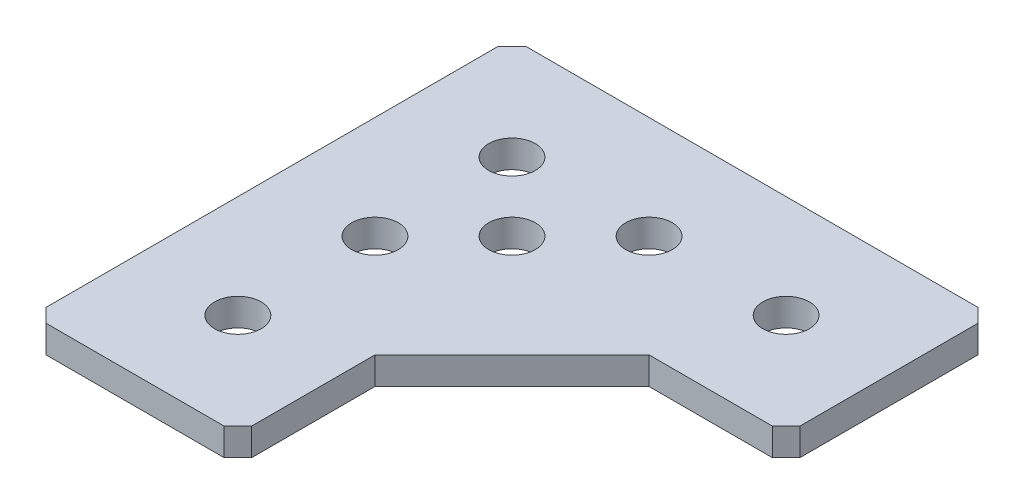
ISO-10303-21;
HEADER;
FILE_DESCRIPTION(('STEP AP214'),'2;1');
FILE_NAME('part.step','',(''),(''),'','','');
FILE_SCHEMA(('AUTOMOTIVE_DESIGN { 1 0 10303 214 1 1 1 1 }'));
ENDSEC;
DATA;
#1=APPLICATION_CONTEXT('core data for automotive mechanical design processes');
#2=APPLICATION_PROTOCOL_DEFINITION('international standard','automotive_design',2000,#1);
#3=PRODUCT_CONTEXT('',#1,'mechanical');
#4=PRODUCT('Part','Part','',(#3));
#5=PRODUCT_RELATED_PRODUCT_CATEGORY('part','',(#4));
#6=PRODUCT_DEFINITION_FORMATION('','',#4);
#7=PRODUCT_DEFINITION_CONTEXT('part definition',#1,'design');
#8=PRODUCT_DEFINITION('design','',#6,#7);
#9=PRODUCT_DEFINITION_SHAPE('','',#8);
#10=(LENGTH_UNIT() NAMED_UNIT(*) SI_UNIT(.MILLI.,.METRE.));
#11=(NAMED_UNIT(*) PLANE_ANGLE_UNIT() SI_UNIT($,.RADIAN.));
#12=(NAMED_UNIT(*) SI_UNIT($,.STERADIAN.) SOLID_ANGLE_UNIT());
#13=UNCERTAINTY_MEASURE_WITH_UNIT(LENGTH_MEASURE(1.E-05),#10,'distance_accuracy_value','');
#14=(GEOMETRIC_REPRESENTATION_CONTEXT(3) GLOBAL_UNCERTAINTY_ASSIGNED_CONTEXT((#13)) GLOBAL_UNIT_ASSIGNED_CONTEXT((#10,
#11,#12)) REPRESENTATION_CONTEXT('',''));
#15=CARTESIAN_POINT('',(0.,0.,0.));
#16=DIRECTION('',(0.,0.,1.));
#17=DIRECTION('',(1.,0.,0.));
#18=AXIS2_PLACEMENT_3D('',#15,#16,#17);
#19=CARTESIAN_POINT('',(-7.5,2.,-6.49999999999999));
#20=DIRECTION('',(0.707106781186548,0.,0.707106781186548));
#21=DIRECTION('',(0.707106781186548,0.,-0.707106781186548));
#22=AXIS2_PLACEMENT_3D('',#19,#20,#21);
#23=PLANE('',#22);
#24=DIRECTION('',(0.,1.,0.));
#25=VECTOR('',#24,1.);
#26=CARTESIAN_POINT('',(-6.49999999999999,2.,-7.5));
#27=LINE('',#26,#25);
#28=CARTESIAN_POINT('',(-6.49999999999999,2.,-7.5));
#29=VERTEX_POINT('',#28);
#30=CARTESIAN_POINT('',(-6.49999999999999,0.,-7.5));
#31=VERTEX_POINT('',#30);
#32=EDGE_CURVE('E101',#29,#31,#27,.F.);
#33=ORIENTED_EDGE('',*,*,#32,.T.);
#34=DIRECTION('',(-0.707106781186547,0.,0.707106781186547));
#35=VECTOR('',#34,1.);
#36=CARTESIAN_POINT('',(-6.49999999999999,0.,-7.5));
#37=LINE('',#36,#35);
#38=CARTESIAN_POINT('',(-7.5,0.,-6.49999999999999));
#39=VERTEX_POINT('',#38);
#40=EDGE_CURVE('E115',#31,#39,#37,.T.);
#41=ORIENTED_EDGE('',*,*,#40,.T.);
#42=DIRECTION('',(0.,1.,0.));
#43=VECTOR('',#42,1.);
#44=CARTESIAN_POINT('',(-7.5,2.,-6.49999999999999));
#45=LINE('',#44,#43);
#46=CARTESIAN_POINT('',(-7.5,2.,-6.49999999999999));
#47=VERTEX_POINT('',#46);
#48=EDGE_CURVE('E216',#39,#47,#45,.T.);
#49=ORIENTED_EDGE('',*,*,#48,.T.);
#50=DIRECTION('',(0.707106781186548,0.,-0.707106781186548));
#51=VECTOR('',#50,1.);
#52=CARTESIAN_POINT('',(-7.5,2.,-6.49999999999999));
#53=LINE('',#52,#51);
#54=EDGE_CURVE('E146',#29,#47,#53,.F.);
#55=ORIENTED_EDGE('',*,*,#54,.F.);
#56=EDGE_LOOP('',(#33,#41,#49,#55));
#57=FACE_BOUND('',#56,.T.);
#58=ADVANCED_FACE('F17',(#57),#23,.F.);
#59=CARTESIAN_POINT('',(-6.5,2.,27.5));
#60=DIRECTION('',(0.707106781186551,0.,-0.707106781186544));
#61=DIRECTION('',(-0.707106781186544,0.,-0.707106781186551));
#62=AXIS2_PLACEMENT_3D('',#59,#60,#61);
#63=PLANE('',#62);
#64=DIRECTION('',(0.,1.,0.));
#65=VECTOR('',#64,1.);
#66=CARTESIAN_POINT('',(-7.50000000000001,2.,26.5));
#67=LINE('',#66,#65);
#68=CARTESIAN_POINT('',(-7.50000000000001,2.,26.5));
#69=VERTEX_POINT('',#68);
#70=CARTESIAN_POINT('',(-7.50000000000001,0.,26.5));
#71=VERTEX_POINT('',#70);
#72=EDGE_CURVE('E124',#69,#71,#67,.F.);
#73=ORIENTED_EDGE('',*,*,#72,.T.);
#74=DIRECTION('',(0.707106781186544,0.,0.707106781186552));
#75=VECTOR('',#74,1.);
#76=CARTESIAN_POINT('',(-7.50000000000001,0.,26.5));
#77=LINE('',#76,#75);
#78=CARTESIAN_POINT('',(-6.5,0.,27.5));
#79=VERTEX_POINT('',#78);
#80=EDGE_CURVE('E137',#71,#79,#77,.T.);
#81=ORIENTED_EDGE('',*,*,#80,.T.);
#82=DIRECTION('',(0.,1.,0.));
#83=VECTOR('',#82,1.);
#84=CARTESIAN_POINT('',(-6.5,2.,27.5));
#85=LINE('',#84,#83);
#86=CARTESIAN_POINT('',(-6.5,2.,27.5));
#87=VERTEX_POINT('',#86);
#88=EDGE_CURVE('E208',#79,#87,#85,.T.);
#89=ORIENTED_EDGE('',*,*,#88,.T.);
#90=DIRECTION('',(-0.707106781186544,0.,-0.707106781186551));
#91=VECTOR('',#90,1.);
#92=CARTESIAN_POINT('',(-6.5,2.,27.5));
#93=LINE('',#92,#91);
#94=EDGE_CURVE('E144',#69,#87,#93,.F.);
#95=ORIENTED_EDGE('',*,*,#94,.F.);
#96=EDGE_LOOP('',(#73,#81,#89,#95));
#97=FACE_BOUND('',#96,.T.);
#98=ADVANCED_FACE('F224',(#97),#63,.F.);
#99=CARTESIAN_POINT('',(7.50000000000001,2.,26.5));
#100=DIRECTION('',(-0.707106781186546,0.,-0.707106781186549));
#101=DIRECTION('',(-0.707106781186549,0.,0.707106781186546));
#102=AXIS2_PLACEMENT_3D('',#99,#100,#101);
#103=PLANE('',#102);
#104=DIRECTION('',(0.,1.,0.));
#105=VECTOR('',#104,1.);
#106=CARTESIAN_POINT('',(6.5,2.,27.5));
#107=LINE('',#106,#105);
#108=CARTESIAN_POINT('',(6.5,2.,27.5));
#109=VERTEX_POINT('',#108);
#110=CARTESIAN_POINT('',(6.5,0.,27.5));
#111=VERTEX_POINT('',#110);
#112=EDGE_CURVE('E214',#109,#111,#107,.F.);
#113=ORIENTED_EDGE('',*,*,#112,.T.);
#114=DIRECTION('',(0.707106781186547,0.,-0.707106781186547));
#115=VECTOR('',#114,1.);
#116=CARTESIAN_POINT('',(6.5,0.,27.5));
#117=LINE('',#116,#115);
#118=CARTESIAN_POINT('',(7.50000000000001,0.,26.5));
#119=VERTEX_POINT('',#118);
#120=EDGE_CURVE('E135',#111,#119,#117,.T.);
#121=ORIENTED_EDGE('',*,*,#120,.T.);
#122=DIRECTION('',(0.,1.,0.));
#123=VECTOR('',#122,1.);
#124=CARTESIAN_POINT('',(7.50000000000001,2.,26.5));
#125=LINE('',#124,#123);
#126=CARTESIAN_POINT('',(7.50000000000001,2.,26.5));
#127=VERTEX_POINT('',#126);
#128=EDGE_CURVE('E202',#119,#127,#125,.T.);
#129=ORIENTED_EDGE('',*,*,#128,.T.);
#130=DIRECTION('',(-0.707106781186549,0.,0.707106781186546));
#131=VECTOR('',#130,1.);
#132=CARTESIAN_POINT('',(7.50000000000001,2.,26.5));
#133=LINE('',#132,#131);
#134=EDGE_CURVE('E142',#109,#127,#133,.F.);
#135=ORIENTED_EDGE('',*,*,#134,.F.);
#136=EDGE_LOOP('',(#113,#121,#129,#135));
#137=FACE_BOUND('',#136,.T.);
#138=ADVANCED_FACE('F270',(#137),#103,.F.);
#139=CARTESIAN_POINT('',(26.5000000000001,2.,-7.5));
#140=DIRECTION('',(-0.707106781186543,0.,0.707106781186552));
#141=DIRECTION('',(0.707106781186552,0.,0.707106781186543));
#142=AXIS2_PLACEMENT_3D('',#139,#140,#141);
#143=PLANE('',#142);
#144=DIRECTION('',(0.,1.,0.));
#145=VECTOR('',#144,1.);
#146=CARTESIAN_POINT('',(27.5,2.,-6.50000000000009));
#147=LINE('',#146,#145);
#148=CARTESIAN_POINT('',(27.5,2.,-6.50000000000009));
#149=VERTEX_POINT('',#148);
#150=CARTESIAN_POINT('',(27.5,0.,-6.50000000000009));
#151=VERTEX_POINT('',#150);
#152=EDGE_CURVE('E111',#149,#151,#147,.F.);
#153=ORIENTED_EDGE('',*,*,#152,.T.);
#154=DIRECTION('',(-0.707106781186554,0.,-0.70710678118654));
#155=VECTOR('',#154,1.);
#156=CARTESIAN_POINT('',(27.5,0.,-6.5000000000001));
#157=LINE('',#156,#155);
#158=CARTESIAN_POINT('',(26.5000000000001,0.,-7.5));
#159=VERTEX_POINT('',#158);
#160=EDGE_CURVE('E105',#151,#159,#157,.T.);
#161=ORIENTED_EDGE('',*,*,#160,.T.);
#162=DIRECTION('',(0.,1.,0.));
#163=VECTOR('',#162,1.);
#164=CARTESIAN_POINT('',(26.5000000000001,2.,-7.5));
#165=LINE('',#164,#163);
#166=CARTESIAN_POINT('',(26.5000000000001,2.,-7.5));
#167=VERTEX_POINT('',#166);
#168=EDGE_CURVE('E109',#159,#167,#165,.T.);
#169=ORIENTED_EDGE('',*,*,#168,.T.);
#170=DIRECTION('',(0.707106781186552,0.,0.707106781186543));
#171=VECTOR('',#170,1.);
#172=CARTESIAN_POINT('',(26.5000000000001,2.,-7.5));
#173=LINE('',#172,#171);
#174=EDGE_CURVE('E35',#149,#167,#173,.F.);
#175=ORIENTED_EDGE('',*,*,#174,.F.);
#176=EDGE_LOOP('',(#153,#161,#169,#175));
#177=FACE_BOUND('',#176,.T.);
#178=ADVANCED_FACE('F107',(#177),#143,.F.);
#179=CARTESIAN_POINT('',(27.5,2.,6.4999999999999));
#180=DIRECTION('',(-0.707106781186549,0.,-0.707106781186546));
#181=DIRECTION('',(-0.707106781186546,0.,0.707106781186549));
#182=AXIS2_PLACEMENT_3D('',#179,#180,#181);
#183=PLANE('',#182);
#184=DIRECTION('',(0.,1.,0.));
#185=VECTOR('',#184,1.);
#186=CARTESIAN_POINT('',(26.5,2.,7.49999999999991));
#187=LINE('',#186,#185);
#188=CARTESIAN_POINT('',(26.5,2.,7.49999999999992));
#189=VERTEX_POINT('',#188);
#190=CARTESIAN_POINT('',(26.5,0.,7.49999999999992));
#191=VERTEX_POINT('',#190);
#192=EDGE_CURVE('E193',#189,#191,#187,.F.);
#193=ORIENTED_EDGE('',*,*,#192,.T.);
#194=DIRECTION('',(0.707106781186546,0.,-0.707106781186549));
#195=VECTOR('',#194,1.);
#196=CARTESIAN_POINT('',(26.5,0.,7.49999999999991));
#197=LINE('',#196,#195);
#198=CARTESIAN_POINT('',(27.5,0.,6.4999999999999));
#199=VERTEX_POINT('',#198);
#200=EDGE_CURVE('E116',#191,#199,#197,.T.);
#201=ORIENTED_EDGE('',*,*,#200,.T.);
#202=DIRECTION('',(0.,1.,0.));
#203=VECTOR('',#202,1.);
#204=CARTESIAN_POINT('',(27.5,2.,6.4999999999999));
#205=LINE('',#204,#203);
#206=CARTESIAN_POINT('',(27.5,2.,6.4999999999999));
#207=VERTEX_POINT('',#206);
#208=EDGE_CURVE('E176',#199,#207,#205,.T.);
#209=ORIENTED_EDGE('',*,*,#208,.T.);
#210=DIRECTION('',(-0.707106781186546,0.,0.707106781186549));
#211=VECTOR('',#210,1.);
#212=CARTESIAN_POINT('',(27.5,2.,6.4999999999999));
#213=LINE('',#212,#211);
#214=EDGE_CURVE('E139',#189,#207,#213,.F.);
#215=ORIENTED_EDGE('',*,*,#214,.F.);
#216=EDGE_LOOP('',(#193,#201,#209,#215));
#217=FACE_BOUND('',#216,.T.);
#218=ADVANCED_FACE('F412',(#217),#183,.F.);
#219=CARTESIAN_POINT('',(0.,0.,0.));
#220=DIRECTION('',(0.,1.,0.));
#221=DIRECTION('',(0.,0.,1.));
#222=AXIS2_PLACEMENT_3D('',#219,#220,#221);
#223=PLANE('',#222);
#224=CARTESIAN_POINT('',(0.,0.,10.));
#225=DIRECTION('',(0.,-1.,0.));
#226=DIRECTION('',(0.,0.,-1.));
#227=AXIS2_PLACEMENT_3D('',#224,#225,#226);
#228=CIRCLE('',#227,1.7);
#229=CARTESIAN_POINT('',(0.,0.,8.30000000000001));
#230=VERTEX_POINT('',#229);
#231=EDGE_CURVE('E163',#230,#230,#228,.F.);
#232=ORIENTED_EDGE('',*,*,#231,.T.);
#233=EDGE_LOOP('',(#232));
#234=FACE_BOUND('',#233,.T.);
#235=CARTESIAN_POINT('',(0.,0.,20.));
#236=DIRECTION('',(0.,-1.,0.));
#237=DIRECTION('',(0.,0.,-1.));
#238=AXIS2_PLACEMENT_3D('',#235,#236,#237);
#239=CIRCLE('',#238,1.7);
#240=CARTESIAN_POINT('',(0.,0.,18.3));
#241=VERTEX_POINT('',#240);
#242=EDGE_CURVE('E166',#241,#241,#239,.F.);
#243=ORIENTED_EDGE('',*,*,#242,.T.);
#244=EDGE_LOOP('',(#243));
#245=FACE_BOUND('',#244,.T.);
#246=CARTESIAN_POINT('',(10.,0.,0.));
#247=DIRECTION('',(0.,-1.,0.));
#248=DIRECTION('',(0.,0.,-1.));
#249=AXIS2_PLACEMENT_3D('',#246,#247,#248);
#250=CIRCLE('',#249,1.7);
#251=CARTESIAN_POINT('',(10.,0.,-1.70000000000004));
#252=VERTEX_POINT('',#251);
#253=EDGE_CURVE('E169',#252,#252,#250,.F.);
#254=ORIENTED_EDGE('',*,*,#253,.T.);
#255=EDGE_LOOP('',(#254));
#256=FACE_BOUND('',#255,.T.);
#257=CARTESIAN_POINT('',(20.,0.,0.));
#258=DIRECTION('',(0.,-1.,0.));
#259=DIRECTION('',(0.,0.,-1.));
#260=AXIS2_PLACEMENT_3D('',#257,#258,#259);
#261=CIRCLE('',#260,1.7);
#262=CARTESIAN_POINT('',(20.,0.,-1.70000000000008));
#263=VERTEX_POINT('',#262);
#264=EDGE_CURVE('E172',#263,#263,#261,.F.);
#265=ORIENTED_EDGE('',*,*,#264,.T.);
#266=EDGE_LOOP('',(#265));
#267=FACE_BOUND('',#266,.T.);
#268=CARTESIAN_POINT('',(0.,0.,0.));
#269=DIRECTION('',(0.,-1.,0.));
#270=DIRECTION('',(0.,0.,-1.));
#271=AXIS2_PLACEMENT_3D('',#268,#269,#270);
#272=CIRCLE('',#271,1.7);
#273=CARTESIAN_POINT('',(0.,0.,-1.69999999999999));
#274=VERTEX_POINT('',#273);
#275=EDGE_CURVE('E174',#274,#274,#272,.F.);
#276=ORIENTED_EDGE('',*,*,#275,.T.);
#277=EDGE_LOOP('',(#276));
#278=FACE_BOUND('',#277,.T.);
#279=ORIENTED_EDGE('',*,*,#40,.F.);
#280=DIRECTION('',(1.,0.,0.));
#281=VECTOR('',#280,1.);
#282=CARTESIAN_POINT('',(-7.5,0.,-7.5));
#283=LINE('',#282,#281);
#284=EDGE_CURVE('E119',#31,#159,#283,.T.);
#285=ORIENTED_EDGE('',*,*,#284,.T.);
#286=ORIENTED_EDGE('',*,*,#160,.F.);
#287=DIRECTION('',(0.,0.,1.));
#288=VECTOR('',#287,1.);
#289=CARTESIAN_POINT('',(27.5,0.,7.4999999999999));
#290=LINE('',#289,#288);
#291=EDGE_CURVE('E180',#151,#199,#290,.T.);
#292=ORIENTED_EDGE('',*,*,#291,.T.);
#293=ORIENTED_EDGE('',*,*,#200,.F.);
#294=DIRECTION('',(-1.,0.,0.));
#295=VECTOR('',#294,1.);
#296=CARTESIAN_POINT('',(-7.49999999999997,0.,7.50000000000002));
#297=LINE('',#296,#295);
#298=CARTESIAN_POINT('',(17.5000000000001,0.,7.49999999999994));
#299=VERTEX_POINT('',#298);
#300=EDGE_CURVE('E190',#191,#299,#297,.T.);
#301=ORIENTED_EDGE('',*,*,#300,.T.);
#302=DIRECTION('',(0.707106781186551,0.,-0.707106781186544));
#303=VECTOR('',#302,1.);
#304=CARTESIAN_POINT('',(17.5000000000001,0.,7.49999999999994));
#305=LINE('',#304,#303);
#306=CARTESIAN_POINT('',(7.50000000000001,0.,17.4999999999999));
#307=VERTEX_POINT('',#306);
#308=EDGE_CURVE('E197',#307,#299,#305,.T.);
#309=ORIENTED_EDGE('',*,*,#308,.F.);
#310=DIRECTION('',(0.,0.,1.));
#311=VECTOR('',#310,1.);
#312=CARTESIAN_POINT('',(7.50000000000001,0.,-7.5));
#313=LINE('',#312,#311);
#314=EDGE_CURVE('E205',#307,#119,#313,.T.);
#315=ORIENTED_EDGE('',*,*,#314,.T.);
#316=ORIENTED_EDGE('',*,*,#120,.F.);
#317=DIRECTION('',(-1.,0.,0.));
#318=VECTOR('',#317,1.);
#319=CARTESIAN_POINT('',(-7.5,0.,27.5));
#320=LINE('',#319,#318);
#321=EDGE_CURVE('E211',#111,#79,#320,.T.);
#322=ORIENTED_EDGE('',*,*,#321,.T.);
#323=ORIENTED_EDGE('',*,*,#80,.F.);
#324=DIRECTION('',(0.,0.,-1.));
#325=VECTOR('',#324,1.);
#326=CARTESIAN_POINT('',(-7.5,0.,-7.5));
#327=LINE('',#326,#325);
#328=EDGE_CURVE('E219',#71,#39,#327,.T.);
#329=ORIENTED_EDGE('',*,*,#328,.T.);
#330=EDGE_LOOP('',(#279,#285,#286,#292,#293,#301,#309,#315,#316,#322,#323,#329));
#331=FACE_BOUND('',#330,.T.);
#332=CARTESIAN_POINT('',(5.,0.,5.00000000000001));
#333=DIRECTION('',(0.,1.,0.));
#334=DIRECTION('',(0.,0.,1.));
#335=AXIS2_PLACEMENT_3D('',#332,#333,#334);
#336=CIRCLE('',#335,1.7);
#337=CARTESIAN_POINT('',(5.,0.,6.70000000000001));
#338=VERTEX_POINT('',#337);
#339=EDGE_CURVE('E20',#338,#338,#336,.T.);
#340=ORIENTED_EDGE('',*,*,#339,.T.);
#341=EDGE_LOOP('',(#340));
#342=FACE_BOUND('',#341,.T.);
#343=ADVANCED_FACE('F120',(#234,#245,#256,#267,#278,#331,#342),#223,.F.);
#344=CARTESIAN_POINT('',(5.,-1.175,5.00000000000001));
#345=DIRECTION('',(0.,1.,0.));
#346=DIRECTION('',(0.,0.,1.));
#347=AXIS2_PLACEMENT_3D('',#344,#345,#346);
#348=CYLINDRICAL_SURFACE('',#347,1.7);
#349=CARTESIAN_POINT('',(5.,2.,5.00000000000001));
#350=DIRECTION('',(0.,1.,0.));
#351=DIRECTION('',(0.,0.,1.));
#352=AXIS2_PLACEMENT_3D('',#349,#350,#351);
#353=CIRCLE('',#352,1.7);
#354=CARTESIAN_POINT('',(5.,2.,6.70000000000001));
#355=VERTEX_POINT('',#354);
#356=EDGE_CURVE('E160',#355,#355,#353,.F.);
#357=ORIENTED_EDGE('',*,*,#356,.F.);
#358=EDGE_LOOP('',(#357));
#359=FACE_BOUND('',#358,.T.);
#360=ORIENTED_EDGE('',*,*,#339,.F.);
#361=EDGE_LOOP('',(#360));
#362=FACE_BOUND('',#361,.T.);
#363=ADVANCED_FACE('F396',(#359,#362),#348,.F.);
#364=CARTESIAN_POINT('',(-7.5,2.,-7.5));
#365=DIRECTION('',(0.,0.,1.));
#366=DIRECTION('',(1.,0.,0.));
#367=AXIS2_PLACEMENT_3D('',#364,#365,#366);
#368=PLANE('',#367);
#369=ORIENTED_EDGE('',*,*,#32,.F.);
#370=DIRECTION('',(1.,0.,0.));
#371=VECTOR('',#370,1.);
#372=CARTESIAN_POINT('',(0.,2.,-7.5));
#373=LINE('',#372,#371);
#374=EDGE_CURVE('E128',#167,#29,#373,.F.);
#375=ORIENTED_EDGE('',*,*,#374,.F.);
#376=ORIENTED_EDGE('',*,*,#168,.F.);
#377=ORIENTED_EDGE('',*,*,#284,.F.);
#378=EDGE_LOOP('',(#369,#375,#376,#377));
#379=FACE_BOUND('',#378,.T.);
#380=ADVANCED_FACE('F126',(#379),#368,.F.);
#381=CARTESIAN_POINT('',(-7.5,2.,-7.5));
#382=DIRECTION('',(1.,0.,0.));
#383=DIRECTION('',(0.,0.,-1.));
#384=AXIS2_PLACEMENT_3D('',#381,#382,#383);
#385=PLANE('',#384);
#386=ORIENTED_EDGE('',*,*,#48,.F.);
#387=ORIENTED_EDGE('',*,*,#328,.F.);
#388=ORIENTED_EDGE('',*,*,#72,.F.);
#389=DIRECTION('',(0.,0.,1.));
#390=VECTOR('',#389,1.);
#391=CARTESIAN_POINT('',(-7.5,2.,0.));
#392=LINE('',#391,#390);
#393=EDGE_CURVE('E234',#47,#69,#392,.T.);
#394=ORIENTED_EDGE('',*,*,#393,.F.);
#395=EDGE_LOOP('',(#386,#387,#388,#394));
#396=FACE_BOUND('',#395,.T.);
#397=ADVANCED_FACE('F233',(#396),#385,.F.);
#398=CARTESIAN_POINT('',(-7.5,2.,27.5));
#399=DIRECTION('',(0.,0.,-1.));
#400=DIRECTION('',(-1.,0.,0.));
#401=AXIS2_PLACEMENT_3D('',#398,#399,#400);
#402=PLANE('',#401);
#403=ORIENTED_EDGE('',*,*,#88,.F.);
#404=ORIENTED_EDGE('',*,*,#321,.F.);
#405=ORIENTED_EDGE('',*,*,#112,.F.);
#406=DIRECTION('',(1.,0.,0.));
#407=VECTOR('',#406,1.);
#408=CARTESIAN_POINT('',(0.,2.,27.5));
#409=LINE('',#408,#407);
#410=EDGE_CURVE('E239',#87,#109,#409,.T.);
#411=ORIENTED_EDGE('',*,*,#410,.F.);
#412=EDGE_LOOP('',(#403,#404,#405,#411));
#413=FACE_BOUND('',#412,.T.);
#414=ADVANCED_FACE('F274',(#413),#402,.F.);
#415=CARTESIAN_POINT('',(7.50000000000001,2.,-7.5));
#416=DIRECTION('',(-1.,0.,0.));
#417=DIRECTION('',(0.,0.,1.));
#418=AXIS2_PLACEMENT_3D('',#415,#416,#417);
#419=PLANE('',#418);
#420=ORIENTED_EDGE('',*,*,#128,.F.);
#421=ORIENTED_EDGE('',*,*,#314,.F.);
#422=DIRECTION('',(0.,1.,0.));
#423=VECTOR('',#422,1.);
#424=CARTESIAN_POINT('',(7.50000000000001,2.,17.4999999999999));
#425=LINE('',#424,#423);
#426=CARTESIAN_POINT('',(7.50000000000001,2.,17.4999999999999));
#427=VERTEX_POINT('',#426);
#428=EDGE_CURVE('E199',#427,#307,#425,.F.);
#429=ORIENTED_EDGE('',*,*,#428,.F.);
#430=DIRECTION('',(0.,0.,1.));
#431=VECTOR('',#430,1.);
#432=CARTESIAN_POINT('',(7.50000000000001,2.,0.));
#433=LINE('',#432,#431);
#434=EDGE_CURVE('E241',#127,#427,#433,.F.);
#435=ORIENTED_EDGE('',*,*,#434,.F.);
#436=EDGE_LOOP('',(#420,#421,#429,#435));
#437=FACE_BOUND('',#436,.T.);
#438=ADVANCED_FACE('F268',(#437),#419,.F.);
#439=CARTESIAN_POINT('',(17.5000000000001,2.,7.49999999999994));
#440=DIRECTION('',(0.707106781186544,0.,0.707106781186551));
#441=DIRECTION('',(0.707106781186551,0.,-0.707106781186544));
#442=AXIS2_PLACEMENT_3D('',#439,#440,#441);
#443=PLANE('',#442);
#444=ORIENTED_EDGE('',*,*,#308,.T.);
#445=DIRECTION('',(0.,1.,0.));
#446=VECTOR('',#445,1.);
#447=CARTESIAN_POINT('',(17.5000000000001,2.,7.49999999999994));
#448=LINE('',#447,#446);
#449=CARTESIAN_POINT('',(17.5000000000001,2.,7.49999999999994));
#450=VERTEX_POINT('',#449);
#451=EDGE_CURVE('E195',#299,#450,#448,.T.);
#452=ORIENTED_EDGE('',*,*,#451,.T.);
#453=DIRECTION('',(0.707106781186551,0.,-0.707106781186544));
#454=VECTOR('',#453,1.);
#455=CARTESIAN_POINT('',(7.50000000000001,2.,17.4999999999999));
#456=LINE('',#455,#454);
#457=EDGE_CURVE('E246',#427,#450,#456,.T.);
#458=ORIENTED_EDGE('',*,*,#457,.F.);
#459=ORIENTED_EDGE('',*,*,#428,.T.);
#460=EDGE_LOOP('',(#444,#452,#458,#459));
#461=FACE_BOUND('',#460,.T.);
#462=ADVANCED_FACE('F264',(#461),#443,.T.);
#463=CARTESIAN_POINT('',(-7.49999999999997,2.,7.50000000000002));
#464=DIRECTION('',(0.,0.,-1.));
#465=DIRECTION('',(-1.,0.,0.));
#466=AXIS2_PLACEMENT_3D('',#463,#464,#465);
#467=PLANE('',#466);
#468=ORIENTED_EDGE('',*,*,#192,.F.);
#469=DIRECTION('',(1.,0.,0.));
#470=VECTOR('',#469,1.);
#471=CARTESIAN_POINT('',(0.,2.,7.49999999999994));
#472=LINE('',#471,#470);
#473=EDGE_CURVE('E249',#450,#189,#472,.T.);
#474=ORIENTED_EDGE('',*,*,#473,.F.);
#475=ORIENTED_EDGE('',*,*,#451,.F.);
#476=ORIENTED_EDGE('',*,*,#300,.F.);
#477=EDGE_LOOP('',(#468,#474,#475,#476));
#478=FACE_BOUND('',#477,.T.);
#479=ADVANCED_FACE('F260',(#478),#467,.F.);
#480=CARTESIAN_POINT('',(27.5,2.,7.4999999999999));
#481=DIRECTION('',(-1.,0.,0.));
#482=DIRECTION('',(0.,0.,1.));
#483=AXIS2_PLACEMENT_3D('',#480,#481,#482);
#484=PLANE('',#483);
#485=ORIENTED_EDGE('',*,*,#208,.F.);
#486=ORIENTED_EDGE('',*,*,#291,.F.);
#487=ORIENTED_EDGE('',*,*,#152,.F.);
#488=DIRECTION('',(0.,0.,1.));
#489=VECTOR('',#488,1.);
#490=CARTESIAN_POINT('',(27.5,2.,0.));
#491=LINE('',#490,#489);
#492=EDGE_CURVE('E159',#207,#149,#491,.F.);
#493=ORIENTED_EDGE('',*,*,#492,.F.);
#494=EDGE_LOOP('',(#485,#486,#487,#493));
#495=FACE_BOUND('',#494,.T.);
#496=ADVANCED_FACE('F253',(#495),#484,.F.);
#497=CARTESIAN_POINT('',(0.,2.,0.));
#498=DIRECTION('',(0.,-1.,0.));
#499=DIRECTION('',(0.,0.,-1.));
#500=AXIS2_PLACEMENT_3D('',#497,#498,#499);
#501=CYLINDRICAL_SURFACE('',#500,1.7);
#502=CARTESIAN_POINT('',(0.,2.,0.));
#503=DIRECTION('',(0.,-1.,0.));
#504=DIRECTION('',(0.,0.,-1.));
#505=AXIS2_PLACEMENT_3D('',#502,#503,#504);
#506=CIRCLE('',#505,1.7);
#507=CARTESIAN_POINT('',(0.,2.,-1.69999999999999));
#508=VERTEX_POINT('',#507);
#509=EDGE_CURVE('E156',#508,#508,#506,.T.);
#510=ORIENTED_EDGE('',*,*,#509,.F.);
#511=EDGE_LOOP('',(#510));
#512=FACE_BOUND('',#511,.T.);
#513=ORIENTED_EDGE('',*,*,#275,.F.);
#514=EDGE_LOOP('',(#513));
#515=FACE_BOUND('',#514,.T.);
#516=ADVANCED_FACE('F306',(#512,#515),#501,.F.);
#517=CARTESIAN_POINT('',(20.,2.,0.));
#518=DIRECTION('',(0.,-1.,0.));
#519=DIRECTION('',(0.,0.,-1.));
#520=AXIS2_PLACEMENT_3D('',#517,#518,#519);
#521=CYLINDRICAL_SURFACE('',#520,1.7);
#522=CARTESIAN_POINT('',(20.,2.,0.));
#523=DIRECTION('',(0.,-1.,0.));
#524=DIRECTION('',(0.,0.,-1.));
#525=AXIS2_PLACEMENT_3D('',#522,#523,#524);
#526=CIRCLE('',#525,1.7);
#527=CARTESIAN_POINT('',(20.,2.,-1.70000000000008));
#528=VERTEX_POINT('',#527);
#529=EDGE_CURVE('E153',#528,#528,#526,.T.);
#530=ORIENTED_EDGE('',*,*,#529,.F.);
#531=EDGE_LOOP('',(#530));
#532=FACE_BOUND('',#531,.T.);
#533=ORIENTED_EDGE('',*,*,#264,.F.);
#534=EDGE_LOOP('',(#533));
#535=FACE_BOUND('',#534,.T.);
#536=ADVANCED_FACE('F302',(#532,#535),#521,.F.);
#537=CARTESIAN_POINT('',(10.,2.,0.));
#538=DIRECTION('',(0.,-1.,0.));
#539=DIRECTION('',(0.,0.,-1.));
#540=AXIS2_PLACEMENT_3D('',#537,#538,#539);
#541=CYLINDRICAL_SURFACE('',#540,1.7);
#542=CARTESIAN_POINT('',(10.,2.,0.));
#543=DIRECTION('',(0.,-1.,0.));
#544=DIRECTION('',(0.,0.,-1.));
#545=AXIS2_PLACEMENT_3D('',#542,#543,#544);
#546=CIRCLE('',#545,1.7);
#547=CARTESIAN_POINT('',(10.,2.,-1.70000000000004));
#548=VERTEX_POINT('',#547);
#549=EDGE_CURVE('E150',#548,#548,#546,.T.);
#550=ORIENTED_EDGE('',*,*,#549,.F.);
#551=EDGE_LOOP('',(#550));
#552=FACE_BOUND('',#551,.T.);
#553=ORIENTED_EDGE('',*,*,#253,.F.);
#554=EDGE_LOOP('',(#553));
#555=FACE_BOUND('',#554,.T.);
#556=ADVANCED_FACE('F298',(#552,#555),#541,.F.);
#557=CARTESIAN_POINT('',(0.,2.,20.));
#558=DIRECTION('',(0.,-1.,0.));
#559=DIRECTION('',(0.,0.,-1.));
#560=AXIS2_PLACEMENT_3D('',#557,#558,#559);
#561=CYLINDRICAL_SURFACE('',#560,1.7);
#562=CARTESIAN_POINT('',(0.,2.,20.));
#563=DIRECTION('',(0.,-1.,0.));
#564=DIRECTION('',(0.,0.,-1.));
#565=AXIS2_PLACEMENT_3D('',#562,#563,#564);
#566=CIRCLE('',#565,1.7);
#567=CARTESIAN_POINT('',(0.,2.,18.3));
#568=VERTEX_POINT('',#567);
#569=EDGE_CURVE('E26',#568,#568,#566,.T.);
#570=ORIENTED_EDGE('',*,*,#569,.F.);
#571=EDGE_LOOP('',(#570));
#572=FACE_BOUND('',#571,.T.);
#573=ORIENTED_EDGE('',*,*,#242,.F.);
#574=EDGE_LOOP('',(#573));
#575=FACE_BOUND('',#574,.T.);
#576=ADVANCED_FACE('F291',(#572,#575),#561,.F.);
#577=CARTESIAN_POINT('',(0.,2.,10.));
#578=DIRECTION('',(0.,-1.,0.));
#579=DIRECTION('',(0.,0.,-1.));
#580=AXIS2_PLACEMENT_3D('',#577,#578,#579);
#581=CYLINDRICAL_SURFACE('',#580,1.7);
#582=CARTESIAN_POINT('',(0.,2.,10.));
#583=DIRECTION('',(0.,-1.,0.));
#584=DIRECTION('',(0.,0.,-1.));
#585=AXIS2_PLACEMENT_3D('',#582,#583,#584);
#586=CIRCLE('',#585,1.7);
#587=CARTESIAN_POINT('',(0.,2.,8.30000000000001));
#588=VERTEX_POINT('',#587);
#589=EDGE_CURVE('E10',#588,#588,#586,.T.);
#590=ORIENTED_EDGE('',*,*,#589,.F.);
#591=EDGE_LOOP('',(#590));
#592=FACE_BOUND('',#591,.T.);
#593=ORIENTED_EDGE('',*,*,#231,.F.);
#594=EDGE_LOOP('',(#593));
#595=FACE_BOUND('',#594,.T.);
#596=ADVANCED_FACE('F285',(#592,#595),#581,.F.);
#597=CARTESIAN_POINT('',(0.,2.,0.));
#598=DIRECTION('',(0.,1.,0.));
#599=DIRECTION('',(0.,0.,1.));
#600=AXIS2_PLACEMENT_3D('',#597,#598,#599);
#601=PLANE('',#600);
#602=ORIENTED_EDGE('',*,*,#589,.T.);
#603=EDGE_LOOP('',(#602));
#604=FACE_BOUND('',#603,.T.);
#605=ORIENTED_EDGE('',*,*,#569,.T.);
#606=EDGE_LOOP('',(#605));
#607=FACE_BOUND('',#606,.T.);
#608=ORIENTED_EDGE('',*,*,#549,.T.);
#609=EDGE_LOOP('',(#608));
#610=FACE_BOUND('',#609,.T.);
#611=ORIENTED_EDGE('',*,*,#529,.T.);
#612=EDGE_LOOP('',(#611));
#613=FACE_BOUND('',#612,.T.);
#614=ORIENTED_EDGE('',*,*,#509,.T.);
#615=EDGE_LOOP('',(#614));
#616=FACE_BOUND('',#615,.T.);
#617=ORIENTED_EDGE('',*,*,#492,.T.);
#618=ORIENTED_EDGE('',*,*,#174,.T.);
#619=ORIENTED_EDGE('',*,*,#374,.T.);
#620=ORIENTED_EDGE('',*,*,#54,.T.);
#621=ORIENTED_EDGE('',*,*,#393,.T.);
#622=ORIENTED_EDGE('',*,*,#94,.T.);
#623=ORIENTED_EDGE('',*,*,#410,.T.);
#624=ORIENTED_EDGE('',*,*,#134,.T.);
#625=ORIENTED_EDGE('',*,*,#434,.T.);
#626=ORIENTED_EDGE('',*,*,#457,.T.);
#627=ORIENTED_EDGE('',*,*,#473,.T.);
#628=ORIENTED_EDGE('',*,*,#214,.T.);
#629=EDGE_LOOP('',(#617,#618,#619,#620,#621,#622,#623,#624,#625,#626,#627,#628));
#630=FACE_BOUND('',#629,.T.);
#631=ORIENTED_EDGE('',*,*,#356,.T.);
#632=EDGE_LOOP('',(#631));
#633=FACE_BOUND('',#632,.T.);
#634=ADVANCED_FACE('F237',(#604,#607,#610,#613,#616,#630,#633),#601,.T.);
#635=CLOSED_SHELL('',(#58,#98,#138,#178,#218,#343,#363,#380,#397,#414,#438,#462,#479,#496,#516,
#536,#556,#576,#596,#634));
#636=MANIFOLD_SOLID_BREP('B1',#635);
#637=ADVANCED_BREP_SHAPE_REPRESENTATION('',(#18,#636),#14);
#638=SHAPE_DEFINITION_REPRESENTATION(#9,#637);
ENDSEC;
END-ISO-10303-21;
